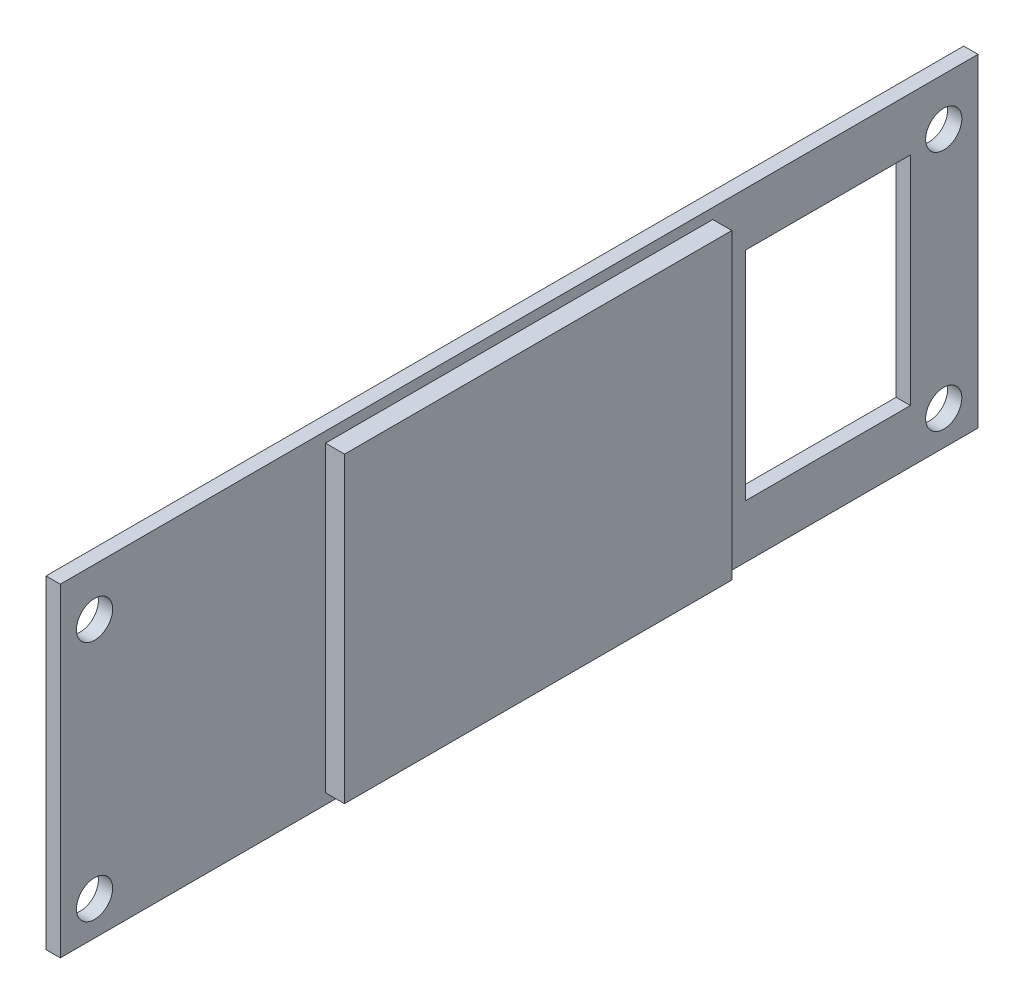
ISO-10303-21;
HEADER;
FILE_DESCRIPTION(('STEP AP214'),'2;1');
FILE_NAME('part.step','',(''),(''),'','','');
FILE_SCHEMA(('AUTOMOTIVE_DESIGN { 1 0 10303 214 1 1 1 1 }'));
ENDSEC;
DATA;
#1=APPLICATION_CONTEXT('core data for automotive mechanical design processes');
#2=APPLICATION_PROTOCOL_DEFINITION('international standard','automotive_design',2000,#1);
#3=PRODUCT_CONTEXT('',#1,'mechanical');
#4=PRODUCT('Part','Part','',(#3));
#5=PRODUCT_RELATED_PRODUCT_CATEGORY('part','',(#4));
#6=PRODUCT_DEFINITION_FORMATION('','',#4);
#7=PRODUCT_DEFINITION_CONTEXT('part definition',#1,'design');
#8=PRODUCT_DEFINITION('design','',#6,#7);
#9=PRODUCT_DEFINITION_SHAPE('','',#8);
#10=(LENGTH_UNIT() NAMED_UNIT(*) SI_UNIT(.MILLI.,.METRE.));
#11=(NAMED_UNIT(*) PLANE_ANGLE_UNIT() SI_UNIT($,.RADIAN.));
#12=(NAMED_UNIT(*) SI_UNIT($,.STERADIAN.) SOLID_ANGLE_UNIT());
#13=UNCERTAINTY_MEASURE_WITH_UNIT(LENGTH_MEASURE(1.E-05),#10,'distance_accuracy_value','');
#14=(GEOMETRIC_REPRESENTATION_CONTEXT(3) GLOBAL_UNCERTAINTY_ASSIGNED_CONTEXT((#13)) GLOBAL_UNIT_ASSIGNED_CONTEXT((#10,
#11,#12)) REPRESENTATION_CONTEXT('',''));
#15=CARTESIAN_POINT('',(0.,0.,0.));
#16=DIRECTION('',(0.,0.,1.));
#17=DIRECTION('',(1.,0.,0.));
#18=AXIS2_PLACEMENT_3D('',#15,#16,#17);
#19=CARTESIAN_POINT('',(0.,0.,0.));
#20=DIRECTION('',(-1.,0.,0.));
#21=DIRECTION('',(0.,0.,1.));
#22=AXIS2_PLACEMENT_3D('',#19,#20,#21);
#23=PLANE('',#22);
#24=DIRECTION('',(0.,1.,0.));
#25=VECTOR('',#24,1.);
#26=CARTESIAN_POINT('',(0.,-21.59,-61.214));
#27=LINE('',#26,#25);
#28=CARTESIAN_POINT('',(0.,-21.59,-61.214));
#29=VERTEX_POINT('',#28);
#30=CARTESIAN_POINT('',(0.,21.59,-61.214));
#31=VERTEX_POINT('',#30);
#32=EDGE_CURVE('E321',#29,#31,#27,.T.);
#33=ORIENTED_EDGE('',*,*,#32,.T.);
#34=DIRECTION('',(0.,0.,1.));
#35=VECTOR('',#34,1.);
#36=CARTESIAN_POINT('',(0.,21.59,61.214));
#37=LINE('',#36,#35);
#38=CARTESIAN_POINT('',(0.,21.59,61.214));
#39=VERTEX_POINT('',#38);
#40=EDGE_CURVE('E337',#31,#39,#37,.T.);
#41=ORIENTED_EDGE('',*,*,#40,.T.);
#42=DIRECTION('',(0.,-1.,0.));
#43=VECTOR('',#42,1.);
#44=CARTESIAN_POINT('',(0.,-21.59,61.214));
#45=LINE('',#44,#43);
#46=CARTESIAN_POINT('',(0.,-21.59,61.214));
#47=VERTEX_POINT('',#46);
#48=EDGE_CURVE('E340',#39,#47,#45,.T.);
#49=ORIENTED_EDGE('',*,*,#48,.T.);
#50=DIRECTION('',(0.,0.,-1.));
#51=VECTOR('',#50,1.);
#52=CARTESIAN_POINT('',(0.,-21.59,61.214));
#53=LINE('',#52,#51);
#54=EDGE_CURVE('E326',#47,#29,#53,.T.);
#55=ORIENTED_EDGE('',*,*,#54,.T.);
#56=EDGE_LOOP('',(#33,#41,#49,#55));
#57=FACE_BOUND('',#56,.T.);
#58=CARTESIAN_POINT('',(0.,15.24,56.642));
#59=DIRECTION('',(1.,0.,0.));
#60=DIRECTION('',(0.,0.,-1.));
#61=AXIS2_PLACEMENT_3D('',#58,#59,#60);
#62=CIRCLE('',#61,2.41299999999999);
#63=CARTESIAN_POINT('',(0.,15.24,54.229));
#64=VERTEX_POINT('',#63);
#65=EDGE_CURVE('E315',#64,#64,#62,.T.);
#66=ORIENTED_EDGE('',*,*,#65,.F.);
#67=EDGE_LOOP('',(#66));
#68=FACE_BOUND('',#67,.T.);
#69=CARTESIAN_POINT('',(0.,-17.018,56.642));
#70=DIRECTION('',(1.,0.,0.));
#71=DIRECTION('',(0.,0.,-1.));
#72=AXIS2_PLACEMENT_3D('',#69,#70,#71);
#73=CIRCLE('',#72,2.413);
#74=CARTESIAN_POINT('',(0.,-17.018,54.229));
#75=VERTEX_POINT('',#74);
#76=EDGE_CURVE('E309',#75,#75,#73,.T.);
#77=ORIENTED_EDGE('',*,*,#76,.F.);
#78=EDGE_LOOP('',(#77));
#79=FACE_BOUND('',#78,.T.);
#80=CARTESIAN_POINT('',(0.,15.24,-56.642));
#81=DIRECTION('',(1.,0.,0.));
#82=DIRECTION('',(0.,0.,1.));
#83=AXIS2_PLACEMENT_3D('',#80,#81,#82);
#84=CIRCLE('',#83,2.41299999999999);
#85=CARTESIAN_POINT('',(0.,15.24,-54.229));
#86=VERTEX_POINT('',#85);
#87=EDGE_CURVE('E303',#86,#86,#84,.T.);
#88=ORIENTED_EDGE('',*,*,#87,.F.);
#89=EDGE_LOOP('',(#88));
#90=FACE_BOUND('',#89,.T.);
#91=CARTESIAN_POINT('',(0.,-17.018,-56.642));
#92=DIRECTION('',(1.,0.,0.));
#93=DIRECTION('',(0.,0.,1.));
#94=AXIS2_PLACEMENT_3D('',#91,#92,#93);
#95=CIRCLE('',#94,2.413);
#96=CARTESIAN_POINT('',(0.,-17.018,-54.229));
#97=VERTEX_POINT('',#96);
#98=EDGE_CURVE('E297',#97,#97,#95,.T.);
#99=ORIENTED_EDGE('',*,*,#98,.F.);
#100=EDGE_LOOP('',(#99));
#101=FACE_BOUND('',#100,.T.);
#102=DIRECTION('',(0.,0.,1.));
#103=VECTOR('',#102,1.);
#104=CARTESIAN_POINT('',(0.,14.478,-52.1970000000001));
#105=LINE('',#104,#103);
#106=CARTESIAN_POINT('',(0.,14.478,-52.1970000000001));
#107=VERTEX_POINT('',#106);
#108=CARTESIAN_POINT('',(0.,14.478,-30.226));
#109=VERTEX_POINT('',#108);
#110=EDGE_CURVE('E202',#107,#109,#105,.T.);
#111=ORIENTED_EDGE('',*,*,#110,.F.);
#112=DIRECTION('',(0.,1.,0.));
#113=VECTOR('',#112,1.);
#114=CARTESIAN_POINT('',(0.,14.478,-52.1970000000001));
#115=LINE('',#114,#113);
#116=CARTESIAN_POINT('',(0.,-14.478,-52.1970000000001));
#117=VERTEX_POINT('',#116);
#118=EDGE_CURVE('E205',#117,#107,#115,.T.);
#119=ORIENTED_EDGE('',*,*,#118,.F.);
#120=DIRECTION('',(0.,0.,-1.));
#121=VECTOR('',#120,1.);
#122=CARTESIAN_POINT('',(0.,-14.478,-52.1970000000001));
#123=LINE('',#122,#121);
#124=CARTESIAN_POINT('',(0.,-14.478,-30.226));
#125=VERTEX_POINT('',#124);
#126=EDGE_CURVE('E206',#125,#117,#123,.T.);
#127=ORIENTED_EDGE('',*,*,#126,.F.);
#128=DIRECTION('',(0.,-1.,0.));
#129=VECTOR('',#128,1.);
#130=CARTESIAN_POINT('',(0.,14.478,-30.226));
#131=LINE('',#130,#129);
#132=EDGE_CURVE('E199',#109,#125,#131,.T.);
#133=ORIENTED_EDGE('',*,*,#132,.F.);
#134=EDGE_LOOP('',(#111,#119,#127,#133));
#135=FACE_BOUND('',#134,.T.);
#136=DIRECTION('',(0.,1.,0.));
#137=VECTOR('',#136,1.);
#138=CARTESIAN_POINT('',(0.,-20.1933527433198,-25.8339416000695));
#139=LINE('',#138,#137);
#140=CARTESIAN_POINT('',(0.,-20.1933527433198,-25.8339416000695));
#141=VERTEX_POINT('',#140);
#142=CARTESIAN_POINT('',(0.,20.1933527433198,-25.8339416000695));
#143=VERTEX_POINT('',#142);
#144=EDGE_CURVE('E190',#141,#143,#139,.T.);
#145=ORIENTED_EDGE('',*,*,#144,.F.);
#146=DIRECTION('',(0.,0.,-1.));
#147=VECTOR('',#146,1.);
#148=CARTESIAN_POINT('',(0.,-20.1933527433198,25.8339416000695));
#149=LINE('',#148,#147);
#150=CARTESIAN_POINT('',(0.,-20.1933527433198,25.8339416000695));
#151=VERTEX_POINT('',#150);
#152=EDGE_CURVE('E187',#151,#141,#149,.T.);
#153=ORIENTED_EDGE('',*,*,#152,.F.);
#154=DIRECTION('',(0.,-1.,0.));
#155=VECTOR('',#154,1.);
#156=CARTESIAN_POINT('',(0.,-20.1933527433198,25.8339416000695));
#157=LINE('',#156,#155);
#158=CARTESIAN_POINT('',(0.,20.1933527433198,25.8339416000695));
#159=VERTEX_POINT('',#158);
#160=EDGE_CURVE('E54',#159,#151,#157,.T.);
#161=ORIENTED_EDGE('',*,*,#160,.F.);
#162=DIRECTION('',(0.,0.,1.));
#163=VECTOR('',#162,1.);
#164=CARTESIAN_POINT('',(0.,20.1933527433198,25.8339416000695));
#165=LINE('',#164,#163);
#166=EDGE_CURVE('E49',#143,#159,#165,.T.);
#167=ORIENTED_EDGE('',*,*,#166,.F.);
#168=EDGE_LOOP('',(#145,#153,#161,#167));
#169=FACE_BOUND('',#168,.T.);
#170=ADVANCED_FACE('F32',(#57,#68,#79,#90,#101,#135,#169),#23,.F.);
#171=CARTESIAN_POINT('',(-1.905,-21.59,-61.214));
#172=DIRECTION('',(0.,0.,-1.));
#173=DIRECTION('',(-1.,0.,0.));
#174=AXIS2_PLACEMENT_3D('',#171,#172,#173);
#175=PLANE('',#174);
#176=ORIENTED_EDGE('',*,*,#32,.F.);
#177=DIRECTION('',(1.,0.,0.));
#178=VECTOR('',#177,1.);
#179=CARTESIAN_POINT('',(-1.905,-21.59,-61.214));
#180=LINE('',#179,#178);
#181=CARTESIAN_POINT('',(-1.905,-21.59,-61.214));
#182=VERTEX_POINT('',#181);
#183=EDGE_CURVE('E11',#182,#29,#180,.T.);
#184=ORIENTED_EDGE('',*,*,#183,.F.);
#185=DIRECTION('',(0.,1.,0.));
#186=VECTOR('',#185,1.);
#187=CARTESIAN_POINT('',(-1.905,-21.59,-61.214));
#188=LINE('',#187,#186);
#189=CARTESIAN_POINT('',(-1.905,21.59,-61.214));
#190=VERTEX_POINT('',#189);
#191=EDGE_CURVE('E322',#182,#190,#188,.T.);
#192=ORIENTED_EDGE('',*,*,#191,.T.);
#193=DIRECTION('',(1.,0.,0.));
#194=VECTOR('',#193,1.);
#195=CARTESIAN_POINT('',(-1.905,21.59,-61.214));
#196=LINE('',#195,#194);
#197=EDGE_CURVE('E36',#190,#31,#196,.T.);
#198=ORIENTED_EDGE('',*,*,#197,.T.);
#199=EDGE_LOOP('',(#176,#184,#192,#198));
#200=FACE_BOUND('',#199,.T.);
#201=ADVANCED_FACE('F34',(#200),#175,.T.);
#202=CARTESIAN_POINT('',(-1.905,-21.59,61.214));
#203=DIRECTION('',(0.,-1.,0.));
#204=DIRECTION('',(0.,0.,-1.));
#205=AXIS2_PLACEMENT_3D('',#202,#203,#204);
#206=PLANE('',#205);
#207=ORIENTED_EDGE('',*,*,#54,.F.);
#208=DIRECTION('',(1.,0.,0.));
#209=VECTOR('',#208,1.);
#210=CARTESIAN_POINT('',(-1.905,-21.59,61.214));
#211=LINE('',#210,#209);
#212=CARTESIAN_POINT('',(-1.905,-21.59,61.214));
#213=VERTEX_POINT('',#212);
#214=EDGE_CURVE('E41',#213,#47,#211,.T.);
#215=ORIENTED_EDGE('',*,*,#214,.F.);
#216=DIRECTION('',(0.,0.,-1.));
#217=VECTOR('',#216,1.);
#218=CARTESIAN_POINT('',(-1.905,-21.59,61.214));
#219=LINE('',#218,#217);
#220=EDGE_CURVE('E332',#213,#182,#219,.T.);
#221=ORIENTED_EDGE('',*,*,#220,.T.);
#222=ORIENTED_EDGE('',*,*,#183,.T.);
#223=EDGE_LOOP('',(#207,#215,#221,#222));
#224=FACE_BOUND('',#223,.T.);
#225=ADVANCED_FACE('F358',(#224),#206,.T.);
#226=CARTESIAN_POINT('',(-1.905,-21.59,61.214));
#227=DIRECTION('',(0.,0.,1.));
#228=DIRECTION('',(1.,0.,0.));
#229=AXIS2_PLACEMENT_3D('',#226,#227,#228);
#230=PLANE('',#229);
#231=ORIENTED_EDGE('',*,*,#48,.F.);
#232=DIRECTION('',(1.,0.,0.));
#233=VECTOR('',#232,1.);
#234=CARTESIAN_POINT('',(-1.905,21.59,61.214));
#235=LINE('',#234,#233);
#236=CARTESIAN_POINT('',(-1.905,21.59,61.214));
#237=VERTEX_POINT('',#236);
#238=EDGE_CURVE('E345',#237,#39,#235,.T.);
#239=ORIENTED_EDGE('',*,*,#238,.F.);
#240=DIRECTION('',(0.,-1.,0.));
#241=VECTOR('',#240,1.);
#242=CARTESIAN_POINT('',(-1.905,-21.59,61.214));
#243=LINE('',#242,#241);
#244=EDGE_CURVE('E329',#237,#213,#243,.T.);
#245=ORIENTED_EDGE('',*,*,#244,.T.);
#246=ORIENTED_EDGE('',*,*,#214,.T.);
#247=EDGE_LOOP('',(#231,#239,#245,#246));
#248=FACE_BOUND('',#247,.T.);
#249=ADVANCED_FACE('F364',(#248),#230,.T.);
#250=CARTESIAN_POINT('',(-1.905,21.59,61.214));
#251=DIRECTION('',(0.,1.,0.));
#252=DIRECTION('',(0.,0.,1.));
#253=AXIS2_PLACEMENT_3D('',#250,#251,#252);
#254=PLANE('',#253);
#255=ORIENTED_EDGE('',*,*,#40,.F.);
#256=ORIENTED_EDGE('',*,*,#197,.F.);
#257=DIRECTION('',(0.,0.,1.));
#258=VECTOR('',#257,1.);
#259=CARTESIAN_POINT('',(-1.905,21.59,61.214));
#260=LINE('',#259,#258);
#261=EDGE_CURVE('E325',#190,#237,#260,.T.);
#262=ORIENTED_EDGE('',*,*,#261,.T.);
#263=ORIENTED_EDGE('',*,*,#238,.T.);
#264=EDGE_LOOP('',(#255,#256,#262,#263));
#265=FACE_BOUND('',#264,.T.);
#266=ADVANCED_FACE('F353',(#265),#254,.T.);
#267=CARTESIAN_POINT('',(-1.905,0.,0.));
#268=DIRECTION('',(-1.,0.,0.));
#269=DIRECTION('',(0.,0.,1.));
#270=AXIS2_PLACEMENT_3D('',#267,#268,#269);
#271=PLANE('',#270);
#272=DIRECTION('',(0.,-1.,0.));
#273=VECTOR('',#272,1.);
#274=CARTESIAN_POINT('',(-1.905,14.478,-52.1970000000001));
#275=LINE('',#274,#273);
#276=CARTESIAN_POINT('',(-1.905,14.478,-52.1970000000001));
#277=VERTEX_POINT('',#276);
#278=CARTESIAN_POINT('',(-1.905,-14.478,-52.1970000000001));
#279=VERTEX_POINT('',#278);
#280=EDGE_CURVE('E191',#277,#279,#275,.T.);
#281=ORIENTED_EDGE('',*,*,#280,.F.);
#282=DIRECTION('',(0.,0.,-1.));
#283=VECTOR('',#282,1.);
#284=CARTESIAN_POINT('',(-1.905,14.478,-52.1970000000001));
#285=LINE('',#284,#283);
#286=CARTESIAN_POINT('',(-1.905,14.478,-30.226));
#287=VERTEX_POINT('',#286);
#288=EDGE_CURVE('E213',#287,#277,#285,.T.);
#289=ORIENTED_EDGE('',*,*,#288,.F.);
#290=DIRECTION('',(0.,1.,0.));
#291=VECTOR('',#290,1.);
#292=CARTESIAN_POINT('',(-1.905,14.478,-30.226));
#293=LINE('',#292,#291);
#294=CARTESIAN_POINT('',(-1.905,-14.478,-30.226));
#295=VERTEX_POINT('',#294);
#296=EDGE_CURVE('E210',#295,#287,#293,.T.);
#297=ORIENTED_EDGE('',*,*,#296,.F.);
#298=DIRECTION('',(0.,0.,1.));
#299=VECTOR('',#298,1.);
#300=CARTESIAN_POINT('',(-1.905,-14.478,-52.1970000000001));
#301=LINE('',#300,#299);
#302=EDGE_CURVE('E193',#279,#295,#301,.T.);
#303=ORIENTED_EDGE('',*,*,#302,.F.);
#304=EDGE_LOOP('',(#281,#289,#297,#303));
#305=FACE_BOUND('',#304,.T.);
#306=CARTESIAN_POINT('',(-1.905,0.,0.));
#307=DIRECTION('',(-1.,0.,0.));
#308=DIRECTION('',(0.,0.,1.));
#309=AXIS2_PLACEMENT_3D('',#306,#307,#308);
#310=CIRCLE('',#309,19.05);
#311=CARTESIAN_POINT('',(-1.905,-15.8042159742455,10.6362238336452));
#312=VERTEX_POINT('',#311);
#313=CARTESIAN_POINT('',(-1.905,-15.8042159742455,-10.6362238336452));
#314=VERTEX_POINT('',#313);
#315=EDGE_CURVE('E229',#312,#314,#310,.F.);
#316=ORIENTED_EDGE('',*,*,#315,.T.);
#317=CARTESIAN_POINT('',(-1.905,-15.715448211871,-15.715448211871));
#318=DIRECTION('',(-1.,0.,0.));
#319=DIRECTION('',(0.,0.,1.));
#320=AXIS2_PLACEMENT_3D('',#317,#318,#319);
#321=CIRCLE('',#320,5.08);
#322=CARTESIAN_POINT('',(-1.905,-10.6362238336452,-15.8042159742455));
#323=VERTEX_POINT('',#322);
#324=EDGE_CURVE('E278',#314,#323,#321,.T.);
#325=ORIENTED_EDGE('',*,*,#324,.T.);
#326=CARTESIAN_POINT('',(-1.905,0.,0.));
#327=DIRECTION('',(-1.,0.,0.));
#328=DIRECTION('',(0.,0.,1.));
#329=AXIS2_PLACEMENT_3D('',#326,#327,#328);
#330=CIRCLE('',#329,19.05);
#331=CARTESIAN_POINT('',(-1.905,10.6362238336452,-15.8042159742455));
#332=VERTEX_POINT('',#331);
#333=EDGE_CURVE('E274',#323,#332,#330,.F.);
#334=ORIENTED_EDGE('',*,*,#333,.T.);
#335=CARTESIAN_POINT('',(-1.905,15.715448211871,-15.715448211871));
#336=DIRECTION('',(-1.,0.,0.));
#337=DIRECTION('',(0.,0.,1.));
#338=AXIS2_PLACEMENT_3D('',#335,#336,#337);
#339=CIRCLE('',#338,5.08);
#340=CARTESIAN_POINT('',(-1.905,15.8042159742455,-10.6362238336452));
#341=VERTEX_POINT('',#340);
#342=EDGE_CURVE('E270',#332,#341,#339,.T.);
#343=ORIENTED_EDGE('',*,*,#342,.T.);
#344=CARTESIAN_POINT('',(-1.905,0.,0.));
#345=DIRECTION('',(-1.,0.,0.));
#346=DIRECTION('',(0.,0.,1.));
#347=AXIS2_PLACEMENT_3D('',#344,#345,#346);
#348=CIRCLE('',#347,19.05);
#349=CARTESIAN_POINT('',(-1.905,15.8042159742455,10.6362238336452));
#350=VERTEX_POINT('',#349);
#351=EDGE_CURVE('E266',#341,#350,#348,.F.);
#352=ORIENTED_EDGE('',*,*,#351,.T.);
#353=CARTESIAN_POINT('',(-1.905,15.715448211871,15.715448211871));
#354=DIRECTION('',(-1.,0.,0.));
#355=DIRECTION('',(0.,0.,1.));
#356=AXIS2_PLACEMENT_3D('',#353,#354,#355);
#357=CIRCLE('',#356,5.08);
#358=CARTESIAN_POINT('',(-1.905,10.6362238336452,15.8042159742455));
#359=VERTEX_POINT('',#358);
#360=EDGE_CURVE('E262',#350,#359,#357,.T.);
#361=ORIENTED_EDGE('',*,*,#360,.T.);
#362=CARTESIAN_POINT('',(-1.905,0.,0.));
#363=DIRECTION('',(-1.,0.,0.));
#364=DIRECTION('',(0.,0.,1.));
#365=AXIS2_PLACEMENT_3D('',#362,#363,#364);
#366=CIRCLE('',#365,19.05);
#367=CARTESIAN_POINT('',(-1.905,-10.6362238336452,15.8042159742455));
#368=VERTEX_POINT('',#367);
#369=EDGE_CURVE('E258',#359,#368,#366,.F.);
#370=ORIENTED_EDGE('',*,*,#369,.T.);
#371=CARTESIAN_POINT('',(-1.905,-15.715448211871,15.715448211871));
#372=DIRECTION('',(-1.,0.,0.));
#373=DIRECTION('',(0.,0.,1.));
#374=AXIS2_PLACEMENT_3D('',#371,#372,#373);
#375=CIRCLE('',#374,5.08);
#376=EDGE_CURVE('E253',#368,#312,#375,.T.);
#377=ORIENTED_EDGE('',*,*,#376,.T.);
#378=EDGE_LOOP('',(#316,#325,#334,#343,#352,#361,#370,#377));
#379=FACE_BOUND('',#378,.T.);
#380=CARTESIAN_POINT('',(-1.905,-17.018,-56.642));
#381=DIRECTION('',(-1.,0.,0.));
#382=DIRECTION('',(0.,0.,1.));
#383=AXIS2_PLACEMENT_3D('',#380,#381,#382);
#384=CIRCLE('',#383,2.413);
#385=CARTESIAN_POINT('',(-1.905,-17.018,-54.229));
#386=VERTEX_POINT('',#385);
#387=EDGE_CURVE('E300',#386,#386,#384,.F.);
#388=ORIENTED_EDGE('',*,*,#387,.T.);
#389=EDGE_LOOP('',(#388));
#390=FACE_BOUND('',#389,.T.);
#391=CARTESIAN_POINT('',(-1.905,15.24,-56.642));
#392=DIRECTION('',(-1.,0.,0.));
#393=DIRECTION('',(0.,0.,1.));
#394=AXIS2_PLACEMENT_3D('',#391,#392,#393);
#395=CIRCLE('',#394,2.41299999999999);
#396=CARTESIAN_POINT('',(-1.905,15.24,-54.229));
#397=VERTEX_POINT('',#396);
#398=EDGE_CURVE('E306',#397,#397,#395,.F.);
#399=ORIENTED_EDGE('',*,*,#398,.T.);
#400=EDGE_LOOP('',(#399));
#401=FACE_BOUND('',#400,.T.);
#402=CARTESIAN_POINT('',(-1.905,-17.018,56.642));
#403=DIRECTION('',(-1.,0.,0.));
#404=DIRECTION('',(0.,0.,1.));
#405=AXIS2_PLACEMENT_3D('',#402,#403,#404);
#406=CIRCLE('',#405,2.413);
#407=CARTESIAN_POINT('',(-1.905,-17.018,59.055));
#408=VERTEX_POINT('',#407);
#409=EDGE_CURVE('E312',#408,#408,#406,.F.);
#410=ORIENTED_EDGE('',*,*,#409,.T.);
#411=EDGE_LOOP('',(#410));
#412=FACE_BOUND('',#411,.T.);
#413=CARTESIAN_POINT('',(-1.905,15.24,56.642));
#414=DIRECTION('',(-1.,0.,0.));
#415=DIRECTION('',(0.,0.,1.));
#416=AXIS2_PLACEMENT_3D('',#413,#414,#415);
#417=CIRCLE('',#416,2.41299999999999);
#418=CARTESIAN_POINT('',(-1.905,15.24,59.055));
#419=VERTEX_POINT('',#418);
#420=EDGE_CURVE('E318',#419,#419,#417,.F.);
#421=ORIENTED_EDGE('',*,*,#420,.T.);
#422=EDGE_LOOP('',(#421));
#423=FACE_BOUND('',#422,.T.);
#424=ORIENTED_EDGE('',*,*,#191,.F.);
#425=ORIENTED_EDGE('',*,*,#220,.F.);
#426=ORIENTED_EDGE('',*,*,#244,.F.);
#427=ORIENTED_EDGE('',*,*,#261,.F.);
#428=EDGE_LOOP('',(#424,#425,#426,#427));
#429=FACE_BOUND('',#428,.T.);
#430=ADVANCED_FACE('F361',(#305,#379,#390,#401,#412,#423,#429),#271,.T.);
#431=CARTESIAN_POINT('',(-8.72999465201255,15.24,56.642));
#432=DIRECTION('',(1.,0.,0.));
#433=DIRECTION('',(0.,0.,-1.));
#434=AXIS2_PLACEMENT_3D('',#431,#432,#433);
#435=CYLINDRICAL_SURFACE('',#434,2.41299999999999);
#436=ORIENTED_EDGE('',*,*,#65,.T.);
#437=EDGE_LOOP('',(#436));
#438=FACE_BOUND('',#437,.T.);
#439=ORIENTED_EDGE('',*,*,#420,.F.);
#440=EDGE_LOOP('',(#439));
#441=FACE_BOUND('',#440,.T.);
#442=ADVANCED_FACE('F380',(#438,#441),#435,.F.);
#443=CARTESIAN_POINT('',(-8.72999465201255,-17.018,56.642));
#444=DIRECTION('',(1.,0.,0.));
#445=DIRECTION('',(0.,0.,-1.));
#446=AXIS2_PLACEMENT_3D('',#443,#444,#445);
#447=CYLINDRICAL_SURFACE('',#446,2.413);
#448=ORIENTED_EDGE('',*,*,#76,.T.);
#449=EDGE_LOOP('',(#448));
#450=FACE_BOUND('',#449,.T.);
#451=ORIENTED_EDGE('',*,*,#409,.F.);
#452=EDGE_LOOP('',(#451));
#453=FACE_BOUND('',#452,.T.);
#454=ADVANCED_FACE('F384',(#450,#453),#447,.F.);
#455=CARTESIAN_POINT('',(-8.72999465201255,15.24,-56.642));
#456=DIRECTION('',(1.,0.,0.));
#457=DIRECTION('',(0.,0.,-1.));
#458=AXIS2_PLACEMENT_3D('',#455,#456,#457);
#459=CYLINDRICAL_SURFACE('',#458,2.41299999999999);
#460=ORIENTED_EDGE('',*,*,#87,.T.);
#461=EDGE_LOOP('',(#460));
#462=FACE_BOUND('',#461,.T.);
#463=ORIENTED_EDGE('',*,*,#398,.F.);
#464=EDGE_LOOP('',(#463));
#465=FACE_BOUND('',#464,.T.);
#466=ADVANCED_FACE('F388',(#462,#465),#459,.F.);
#467=CARTESIAN_POINT('',(-8.72999465201255,-17.018,-56.642));
#468=DIRECTION('',(1.,0.,0.));
#469=DIRECTION('',(0.,0.,-1.));
#470=AXIS2_PLACEMENT_3D('',#467,#468,#469);
#471=CYLINDRICAL_SURFACE('',#470,2.413);
#472=ORIENTED_EDGE('',*,*,#98,.T.);
#473=EDGE_LOOP('',(#472));
#474=FACE_BOUND('',#473,.T.);
#475=ORIENTED_EDGE('',*,*,#387,.F.);
#476=EDGE_LOOP('',(#475));
#477=FACE_BOUND('',#476,.T.);
#478=ADVANCED_FACE('F392',(#474,#477),#471,.F.);
#479=CARTESIAN_POINT('',(-55.7865367264149,0.,0.));
#480=DIRECTION('',(1.,0.,0.));
#481=DIRECTION('',(0.,0.,-1.));
#482=AXIS2_PLACEMENT_3D('',#479,#480,#481);
#483=CYLINDRICAL_SURFACE('',#482,19.05);
#484=DIRECTION('',(1.,0.,0.));
#485=VECTOR('',#484,1.);
#486=CARTESIAN_POINT('',(-55.7865367264149,-15.8042159742455,10.6362238336453));
#487=LINE('',#486,#485);
#488=CARTESIAN_POINT('',(0.,-15.8042159742455,10.6362238336453));
#489=VERTEX_POINT('',#488);
#490=EDGE_CURVE('E256',#312,#489,#487,.T.);
#491=ORIENTED_EDGE('',*,*,#490,.T.);
#492=CARTESIAN_POINT('',(0.,0.,0.));
#493=DIRECTION('',(1.,0.,0.));
#494=DIRECTION('',(0.,0.,-1.));
#495=AXIS2_PLACEMENT_3D('',#492,#493,#494);
#496=CIRCLE('',#495,19.05);
#497=CARTESIAN_POINT('',(0.,-15.8042159742455,-10.6362238336452));
#498=VERTEX_POINT('',#497);
#499=EDGE_CURVE('E245',#489,#498,#496,.T.);
#500=ORIENTED_EDGE('',*,*,#499,.T.);
#501=DIRECTION('',(1.,0.,0.));
#502=VECTOR('',#501,1.);
#503=CARTESIAN_POINT('',(-55.7865367264149,-15.8042159742455,-10.6362238336452));
#504=LINE('',#503,#502);
#505=EDGE_CURVE('E252',#314,#498,#504,.T.);
#506=ORIENTED_EDGE('',*,*,#505,.F.);
#507=ORIENTED_EDGE('',*,*,#315,.F.);
#508=EDGE_LOOP('',(#491,#500,#506,#507));
#509=FACE_BOUND('',#508,.T.);
#510=ADVANCED_FACE('F396',(#509),#483,.F.);
#511=CARTESIAN_POINT('',(-55.7865367264149,-15.715448211871,-15.715448211871));
#512=DIRECTION('',(1.,0.,0.));
#513=DIRECTION('',(0.,0.,-1.));
#514=AXIS2_PLACEMENT_3D('',#511,#512,#513);
#515=CYLINDRICAL_SURFACE('',#514,5.08);
#516=ORIENTED_EDGE('',*,*,#505,.T.);
#517=CARTESIAN_POINT('',(0.,-15.715448211871,-15.715448211871));
#518=DIRECTION('',(-1.,0.,0.));
#519=DIRECTION('',(0.,0.,-1.));
#520=AXIS2_PLACEMENT_3D('',#517,#518,#519);
#521=CIRCLE('',#520,5.08);
#522=CARTESIAN_POINT('',(0.,-10.6362238336452,-15.8042159742455));
#523=VERTEX_POINT('',#522);
#524=EDGE_CURVE('E242',#498,#523,#521,.T.);
#525=ORIENTED_EDGE('',*,*,#524,.T.);
#526=DIRECTION('',(1.,0.,0.));
#527=VECTOR('',#526,1.);
#528=CARTESIAN_POINT('',(-55.7865367264149,-10.6362238336452,-15.8042159742455));
#529=LINE('',#528,#527);
#530=EDGE_CURVE('E277',#323,#523,#529,.T.);
#531=ORIENTED_EDGE('',*,*,#530,.F.);
#532=ORIENTED_EDGE('',*,*,#324,.F.);
#533=EDGE_LOOP('',(#516,#525,#531,#532));
#534=FACE_BOUND('',#533,.T.);
#535=ADVANCED_FACE('F400',(#534),#515,.T.);
#536=CARTESIAN_POINT('',(-55.7865367264149,0.,0.));
#537=DIRECTION('',(1.,0.,0.));
#538=DIRECTION('',(0.,0.,-1.));
#539=AXIS2_PLACEMENT_3D('',#536,#537,#538);
#540=CYLINDRICAL_SURFACE('',#539,19.05);
#541=ORIENTED_EDGE('',*,*,#530,.T.);
#542=CARTESIAN_POINT('',(0.,0.,0.));
#543=DIRECTION('',(1.,0.,0.));
#544=DIRECTION('',(0.,0.,-1.));
#545=AXIS2_PLACEMENT_3D('',#542,#543,#544);
#546=CIRCLE('',#545,19.05);
#547=CARTESIAN_POINT('',(0.,10.6362238336452,-15.8042159742455));
#548=VERTEX_POINT('',#547);
#549=EDGE_CURVE('E239',#523,#548,#546,.T.);
#550=ORIENTED_EDGE('',*,*,#549,.T.);
#551=DIRECTION('',(1.,0.,0.));
#552=VECTOR('',#551,1.);
#553=CARTESIAN_POINT('',(-55.7865367264149,10.6362238336452,-15.8042159742455));
#554=LINE('',#553,#552);
#555=EDGE_CURVE('E273',#332,#548,#554,.T.);
#556=ORIENTED_EDGE('',*,*,#555,.F.);
#557=ORIENTED_EDGE('',*,*,#333,.F.);
#558=EDGE_LOOP('',(#541,#550,#556,#557));
#559=FACE_BOUND('',#558,.T.);
#560=ADVANCED_FACE('F404',(#559),#540,.F.);
#561=CARTESIAN_POINT('',(-55.7865367264149,15.715448211871,-15.715448211871));
#562=DIRECTION('',(1.,0.,0.));
#563=DIRECTION('',(0.,0.,-1.));
#564=AXIS2_PLACEMENT_3D('',#561,#562,#563);
#565=CYLINDRICAL_SURFACE('',#564,5.08);
#566=ORIENTED_EDGE('',*,*,#555,.T.);
#567=CARTESIAN_POINT('',(0.,15.715448211871,-15.715448211871));
#568=DIRECTION('',(-1.,0.,0.));
#569=DIRECTION('',(0.,0.,1.));
#570=AXIS2_PLACEMENT_3D('',#567,#568,#569);
#571=CIRCLE('',#570,5.08);
#572=CARTESIAN_POINT('',(0.,15.8042159742455,-10.6362238336452));
#573=VERTEX_POINT('',#572);
#574=EDGE_CURVE('E236',#548,#573,#571,.T.);
#575=ORIENTED_EDGE('',*,*,#574,.T.);
#576=DIRECTION('',(1.,0.,0.));
#577=VECTOR('',#576,1.);
#578=CARTESIAN_POINT('',(-55.7865367264149,15.8042159742455,-10.6362238336452));
#579=LINE('',#578,#577);
#580=EDGE_CURVE('E269',#341,#573,#579,.T.);
#581=ORIENTED_EDGE('',*,*,#580,.F.);
#582=ORIENTED_EDGE('',*,*,#342,.F.);
#583=EDGE_LOOP('',(#566,#575,#581,#582));
#584=FACE_BOUND('',#583,.T.);
#585=ADVANCED_FACE('F408',(#584),#565,.T.);
#586=CARTESIAN_POINT('',(-55.7865367264149,0.,0.));
#587=DIRECTION('',(1.,0.,0.));
#588=DIRECTION('',(0.,0.,-1.));
#589=AXIS2_PLACEMENT_3D('',#586,#587,#588);
#590=CYLINDRICAL_SURFACE('',#589,19.05);
#591=ORIENTED_EDGE('',*,*,#580,.T.);
#592=CARTESIAN_POINT('',(0.,0.,0.));
#593=DIRECTION('',(1.,0.,0.));
#594=DIRECTION('',(0.,0.,-1.));
#595=AXIS2_PLACEMENT_3D('',#592,#593,#594);
#596=CIRCLE('',#595,19.05);
#597=CARTESIAN_POINT('',(0.,15.8042159742455,10.6362238336452));
#598=VERTEX_POINT('',#597);
#599=EDGE_CURVE('E233',#573,#598,#596,.T.);
#600=ORIENTED_EDGE('',*,*,#599,.T.);
#601=DIRECTION('',(1.,0.,0.));
#602=VECTOR('',#601,1.);
#603=CARTESIAN_POINT('',(-55.7865367264149,15.8042159742455,10.6362238336452));
#604=LINE('',#603,#602);
#605=EDGE_CURVE('E265',#350,#598,#604,.T.);
#606=ORIENTED_EDGE('',*,*,#605,.F.);
#607=ORIENTED_EDGE('',*,*,#351,.F.);
#608=EDGE_LOOP('',(#591,#600,#606,#607));
#609=FACE_BOUND('',#608,.T.);
#610=ADVANCED_FACE('F412',(#609),#590,.F.);
#611=CARTESIAN_POINT('',(-55.7865367264149,15.715448211871,15.715448211871));
#612=DIRECTION('',(1.,0.,0.));
#613=DIRECTION('',(0.,0.,-1.));
#614=AXIS2_PLACEMENT_3D('',#611,#612,#613);
#615=CYLINDRICAL_SURFACE('',#614,5.08);
#616=ORIENTED_EDGE('',*,*,#605,.T.);
#617=CARTESIAN_POINT('',(0.,15.715448211871,15.715448211871));
#618=DIRECTION('',(-1.,0.,0.));
#619=DIRECTION('',(0.,0.,-1.));
#620=AXIS2_PLACEMENT_3D('',#617,#618,#619);
#621=CIRCLE('',#620,5.08);
#622=CARTESIAN_POINT('',(0.,10.6362238336452,15.8042159742455));
#623=VERTEX_POINT('',#622);
#624=EDGE_CURVE('E230',#598,#623,#621,.T.);
#625=ORIENTED_EDGE('',*,*,#624,.T.);
#626=DIRECTION('',(1.,0.,0.));
#627=VECTOR('',#626,1.);
#628=CARTESIAN_POINT('',(-55.7865367264149,10.6362238336452,15.8042159742455));
#629=LINE('',#628,#627);
#630=EDGE_CURVE('E261',#359,#623,#629,.T.);
#631=ORIENTED_EDGE('',*,*,#630,.F.);
#632=ORIENTED_EDGE('',*,*,#360,.F.);
#633=EDGE_LOOP('',(#616,#625,#631,#632));
#634=FACE_BOUND('',#633,.T.);
#635=ADVANCED_FACE('F416',(#634),#615,.T.);
#636=CARTESIAN_POINT('',(-55.7865367264149,0.,0.));
#637=DIRECTION('',(1.,0.,0.));
#638=DIRECTION('',(0.,0.,-1.));
#639=AXIS2_PLACEMENT_3D('',#636,#637,#638);
#640=CYLINDRICAL_SURFACE('',#639,19.05);
#641=ORIENTED_EDGE('',*,*,#630,.T.);
#642=CARTESIAN_POINT('',(0.,0.,0.));
#643=DIRECTION('',(1.,0.,0.));
#644=DIRECTION('',(0.,0.,-1.));
#645=AXIS2_PLACEMENT_3D('',#642,#643,#644);
#646=CIRCLE('',#645,19.05);
#647=CARTESIAN_POINT('',(0.,-10.6362238336452,15.8042159742455));
#648=VERTEX_POINT('',#647);
#649=EDGE_CURVE('E226',#623,#648,#646,.T.);
#650=ORIENTED_EDGE('',*,*,#649,.T.);
#651=DIRECTION('',(1.,0.,0.));
#652=VECTOR('',#651,1.);
#653=CARTESIAN_POINT('',(-55.7865367264149,-10.6362238336452,15.8042159742455));
#654=LINE('',#653,#652);
#655=EDGE_CURVE('E257',#368,#648,#654,.T.);
#656=ORIENTED_EDGE('',*,*,#655,.F.);
#657=ORIENTED_EDGE('',*,*,#369,.F.);
#658=EDGE_LOOP('',(#641,#650,#656,#657));
#659=FACE_BOUND('',#658,.T.);
#660=ADVANCED_FACE('F420',(#659),#640,.F.);
#661=CARTESIAN_POINT('',(-55.7865367264149,-15.715448211871,15.715448211871));
#662=DIRECTION('',(1.,0.,0.));
#663=DIRECTION('',(0.,0.,-1.));
#664=AXIS2_PLACEMENT_3D('',#661,#662,#663);
#665=CYLINDRICAL_SURFACE('',#664,5.08);
#666=ORIENTED_EDGE('',*,*,#655,.T.);
#667=CARTESIAN_POINT('',(0.,-15.715448211871,15.715448211871));
#668=DIRECTION('',(-1.,0.,0.));
#669=DIRECTION('',(0.,0.,1.));
#670=AXIS2_PLACEMENT_3D('',#667,#668,#669);
#671=CIRCLE('',#670,5.08);
#672=EDGE_CURVE('E225',#648,#489,#671,.T.);
#673=ORIENTED_EDGE('',*,*,#672,.T.);
#674=ORIENTED_EDGE('',*,*,#490,.F.);
#675=ORIENTED_EDGE('',*,*,#376,.F.);
#676=EDGE_LOOP('',(#666,#673,#674,#675));
#677=FACE_BOUND('',#676,.T.);
#678=ADVANCED_FACE('F424',(#677),#665,.T.);
#679=CARTESIAN_POINT('',(36.3479679899716,14.478,-52.1970000000001));
#680=DIRECTION('',(0.,0.,-1.));
#681=DIRECTION('',(-1.,0.,0.));
#682=AXIS2_PLACEMENT_3D('',#679,#680,#681);
#683=PLANE('',#682);
#684=ORIENTED_EDGE('',*,*,#118,.T.);
#685=DIRECTION('',(-1.,0.,0.));
#686=VECTOR('',#685,1.);
#687=CARTESIAN_POINT('',(36.3479679899716,14.478,-52.1970000000001));
#688=LINE('',#687,#686);
#689=EDGE_CURVE('E203',#107,#277,#688,.T.);
#690=ORIENTED_EDGE('',*,*,#689,.T.);
#691=ORIENTED_EDGE('',*,*,#280,.T.);
#692=DIRECTION('',(-1.,0.,0.));
#693=VECTOR('',#692,1.);
#694=CARTESIAN_POINT('',(36.3479679899716,-14.478,-52.1970000000001));
#695=LINE('',#694,#693);
#696=EDGE_CURVE('E216',#117,#279,#695,.T.);
#697=ORIENTED_EDGE('',*,*,#696,.F.);
#698=EDGE_LOOP('',(#684,#690,#691,#697));
#699=FACE_BOUND('',#698,.T.);
#700=ADVANCED_FACE('F428',(#699),#683,.F.);
#701=CARTESIAN_POINT('',(36.3479679899716,14.478,-52.1970000000001));
#702=DIRECTION('',(0.,1.,0.));
#703=DIRECTION('',(0.,0.,1.));
#704=AXIS2_PLACEMENT_3D('',#701,#702,#703);
#705=PLANE('',#704);
#706=ORIENTED_EDGE('',*,*,#110,.T.);
#707=DIRECTION('',(-1.,0.,0.));
#708=VECTOR('',#707,1.);
#709=CARTESIAN_POINT('',(36.3479679899716,14.478,-30.226));
#710=LINE('',#709,#708);
#711=EDGE_CURVE('E218',#109,#287,#710,.T.);
#712=ORIENTED_EDGE('',*,*,#711,.T.);
#713=ORIENTED_EDGE('',*,*,#288,.T.);
#714=ORIENTED_EDGE('',*,*,#689,.F.);
#715=EDGE_LOOP('',(#706,#712,#713,#714));
#716=FACE_BOUND('',#715,.T.);
#717=ADVANCED_FACE('F432',(#716),#705,.F.);
#718=CARTESIAN_POINT('',(36.3479679899716,14.478,-30.226));
#719=DIRECTION('',(0.,0.,1.));
#720=DIRECTION('',(1.,0.,0.));
#721=AXIS2_PLACEMENT_3D('',#718,#719,#720);
#722=PLANE('',#721);
#723=ORIENTED_EDGE('',*,*,#132,.T.);
#724=DIRECTION('',(-1.,0.,0.));
#725=VECTOR('',#724,1.);
#726=CARTESIAN_POINT('',(36.3479679899716,-14.478,-30.226));
#727=LINE('',#726,#725);
#728=EDGE_CURVE('E220',#125,#295,#727,.T.);
#729=ORIENTED_EDGE('',*,*,#728,.T.);
#730=ORIENTED_EDGE('',*,*,#296,.T.);
#731=ORIENTED_EDGE('',*,*,#711,.F.);
#732=EDGE_LOOP('',(#723,#729,#730,#731));
#733=FACE_BOUND('',#732,.T.);
#734=ADVANCED_FACE('F438',(#733),#722,.F.);
#735=CARTESIAN_POINT('',(36.3479679899716,-14.478,-52.1970000000001));
#736=DIRECTION('',(0.,-1.,0.));
#737=DIRECTION('',(0.,0.,-1.));
#738=AXIS2_PLACEMENT_3D('',#735,#736,#737);
#739=PLANE('',#738);
#740=ORIENTED_EDGE('',*,*,#126,.T.);
#741=ORIENTED_EDGE('',*,*,#696,.T.);
#742=ORIENTED_EDGE('',*,*,#302,.T.);
#743=ORIENTED_EDGE('',*,*,#728,.F.);
#744=EDGE_LOOP('',(#740,#741,#742,#743));
#745=FACE_BOUND('',#744,.T.);
#746=ADVANCED_FACE('F434',(#745),#739,.F.);
#747=CARTESIAN_POINT('',(0.,0.,0.));
#748=DIRECTION('',(-1.,0.,0.));
#749=DIRECTION('',(0.,0.,1.));
#750=AXIS2_PLACEMENT_3D('',#747,#748,#749);
#751=PLANE('',#750);
#752=ORIENTED_EDGE('',*,*,#499,.F.);
#753=ORIENTED_EDGE('',*,*,#672,.F.);
#754=ORIENTED_EDGE('',*,*,#649,.F.);
#755=ORIENTED_EDGE('',*,*,#624,.F.);
#756=ORIENTED_EDGE('',*,*,#599,.F.);
#757=ORIENTED_EDGE('',*,*,#574,.F.);
#758=ORIENTED_EDGE('',*,*,#549,.F.);
#759=ORIENTED_EDGE('',*,*,#524,.F.);
#760=EDGE_LOOP('',(#752,#753,#754,#755,#756,#757,#758,#759));
#761=FACE_BOUND('',#760,.T.);
#762=ADVANCED_FACE('F437',(#761),#751,.T.);
#763=CARTESIAN_POINT('',(2.54,-20.1933527433198,-25.8339416000695));
#764=DIRECTION('',(0.,0.,1.));
#765=DIRECTION('',(1.,0.,0.));
#766=AXIS2_PLACEMENT_3D('',#763,#764,#765);
#767=PLANE('',#766);
#768=ORIENTED_EDGE('',*,*,#144,.T.);
#769=DIRECTION('',(-1.,0.,0.));
#770=VECTOR('',#769,1.);
#771=CARTESIAN_POINT('',(2.54,20.1933527433198,-25.8339416000695));
#772=LINE('',#771,#770);
#773=CARTESIAN_POINT('',(2.54,20.1933527433198,-25.8339416000695));
#774=VERTEX_POINT('',#773);
#775=EDGE_CURVE('E171',#774,#143,#772,.T.);
#776=ORIENTED_EDGE('',*,*,#775,.F.);
#777=DIRECTION('',(0.,1.,0.));
#778=VECTOR('',#777,1.);
#779=CARTESIAN_POINT('',(2.54,-20.1933527433198,-25.8339416000695));
#780=LINE('',#779,#778);
#781=CARTESIAN_POINT('',(2.54,-20.1933527433198,-25.8339416000695));
#782=VERTEX_POINT('',#781);
#783=EDGE_CURVE('E178',#782,#774,#780,.T.);
#784=ORIENTED_EDGE('',*,*,#783,.F.);
#785=DIRECTION('',(-1.,0.,0.));
#786=VECTOR('',#785,1.);
#787=CARTESIAN_POINT('',(2.54,-20.1933527433198,-25.8339416000695));
#788=LINE('',#787,#786);
#789=EDGE_CURVE('E649',#782,#141,#788,.T.);
#790=ORIENTED_EDGE('',*,*,#789,.T.);
#791=EDGE_LOOP('',(#768,#776,#784,#790));
#792=FACE_BOUND('',#791,.T.);
#793=ADVANCED_FACE('F189',(#792),#767,.F.);
#794=CARTESIAN_POINT('',(2.54,20.1933527433198,25.8339416000695));
#795=DIRECTION('',(0.,-1.,0.));
#796=DIRECTION('',(0.,0.,-1.));
#797=AXIS2_PLACEMENT_3D('',#794,#795,#796);
#798=PLANE('',#797);
#799=ORIENTED_EDGE('',*,*,#166,.T.);
#800=DIRECTION('',(-1.,0.,0.));
#801=VECTOR('',#800,1.);
#802=CARTESIAN_POINT('',(2.54,20.1933527433198,25.8339416000695));
#803=LINE('',#802,#801);
#804=CARTESIAN_POINT('',(2.54,20.1933527433198,25.8339416000695));
#805=VERTEX_POINT('',#804);
#806=EDGE_CURVE('E174',#805,#159,#803,.T.);
#807=ORIENTED_EDGE('',*,*,#806,.F.);
#808=DIRECTION('',(0.,0.,1.));
#809=VECTOR('',#808,1.);
#810=CARTESIAN_POINT('',(2.54,20.1933527433198,25.8339416000695));
#811=LINE('',#810,#809);
#812=EDGE_CURVE('E167',#774,#805,#811,.T.);
#813=ORIENTED_EDGE('',*,*,#812,.F.);
#814=ORIENTED_EDGE('',*,*,#775,.T.);
#815=EDGE_LOOP('',(#799,#807,#813,#814));
#816=FACE_BOUND('',#815,.T.);
#817=ADVANCED_FACE('F169',(#816),#798,.F.);
#818=CARTESIAN_POINT('',(2.54,-20.1933527433198,25.8339416000695));
#819=DIRECTION('',(0.,0.,-1.));
#820=DIRECTION('',(-1.,0.,0.));
#821=AXIS2_PLACEMENT_3D('',#818,#819,#820);
#822=PLANE('',#821);
#823=ORIENTED_EDGE('',*,*,#160,.T.);
#824=DIRECTION('',(-1.,0.,0.));
#825=VECTOR('',#824,1.);
#826=CARTESIAN_POINT('',(2.54,-20.1933527433198,25.8339416000695));
#827=LINE('',#826,#825);
#828=CARTESIAN_POINT('',(2.54,-20.1933527433198,25.8339416000695));
#829=VERTEX_POINT('',#828);
#830=EDGE_CURVE('E195',#829,#151,#827,.T.);
#831=ORIENTED_EDGE('',*,*,#830,.F.);
#832=DIRECTION('',(0.,-1.,0.));
#833=VECTOR('',#832,1.);
#834=CARTESIAN_POINT('',(2.54,-20.1933527433198,25.8339416000695));
#835=LINE('',#834,#833);
#836=EDGE_CURVE('E177',#805,#829,#835,.T.);
#837=ORIENTED_EDGE('',*,*,#836,.F.);
#838=ORIENTED_EDGE('',*,*,#806,.T.);
#839=EDGE_LOOP('',(#823,#831,#837,#838));
#840=FACE_BOUND('',#839,.T.);
#841=ADVANCED_FACE('F450',(#840),#822,.F.);
#842=CARTESIAN_POINT('',(2.54,-20.1933527433198,25.8339416000695));
#843=DIRECTION('',(0.,1.,0.));
#844=DIRECTION('',(0.,0.,1.));
#845=AXIS2_PLACEMENT_3D('',#842,#843,#844);
#846=PLANE('',#845);
#847=ORIENTED_EDGE('',*,*,#152,.T.);
#848=ORIENTED_EDGE('',*,*,#789,.F.);
#849=DIRECTION('',(0.,0.,-1.));
#850=VECTOR('',#849,1.);
#851=CARTESIAN_POINT('',(2.54,-20.1933527433198,25.8339416000695));
#852=LINE('',#851,#850);
#853=EDGE_CURVE('E183',#829,#782,#852,.T.);
#854=ORIENTED_EDGE('',*,*,#853,.F.);
#855=ORIENTED_EDGE('',*,*,#830,.T.);
#856=EDGE_LOOP('',(#847,#848,#854,#855));
#857=FACE_BOUND('',#856,.T.);
#858=ADVANCED_FACE('F453',(#857),#846,.F.);
#859=CARTESIAN_POINT('',(2.54,0.,0.));
#860=DIRECTION('',(-1.,0.,0.));
#861=DIRECTION('',(0.,0.,1.));
#862=AXIS2_PLACEMENT_3D('',#859,#860,#861);
#863=PLANE('',#862);
#864=ORIENTED_EDGE('',*,*,#783,.T.);
#865=ORIENTED_EDGE('',*,*,#812,.T.);
#866=ORIENTED_EDGE('',*,*,#836,.T.);
#867=ORIENTED_EDGE('',*,*,#853,.T.);
#868=EDGE_LOOP('',(#864,#865,#866,#867));
#869=FACE_BOUND('',#868,.T.);
#870=ADVANCED_FACE('F181',(#869),#863,.F.);
#871=CLOSED_SHELL('',(#170,#201,#225,#249,#266,#430,#442,#454,#466,#478,#510,#535,#560,#585,
#610,#635,#660,#678,#700,#717,#734,#746,#762,#793,#817,#841,#858,#870));
#872=MANIFOLD_SOLID_BREP('B2',#871);
#873=ADVANCED_BREP_SHAPE_REPRESENTATION('',(#18,#872),#14);
#874=SHAPE_DEFINITION_REPRESENTATION(#9,#873);
ENDSEC;
END-ISO-10303-21;
